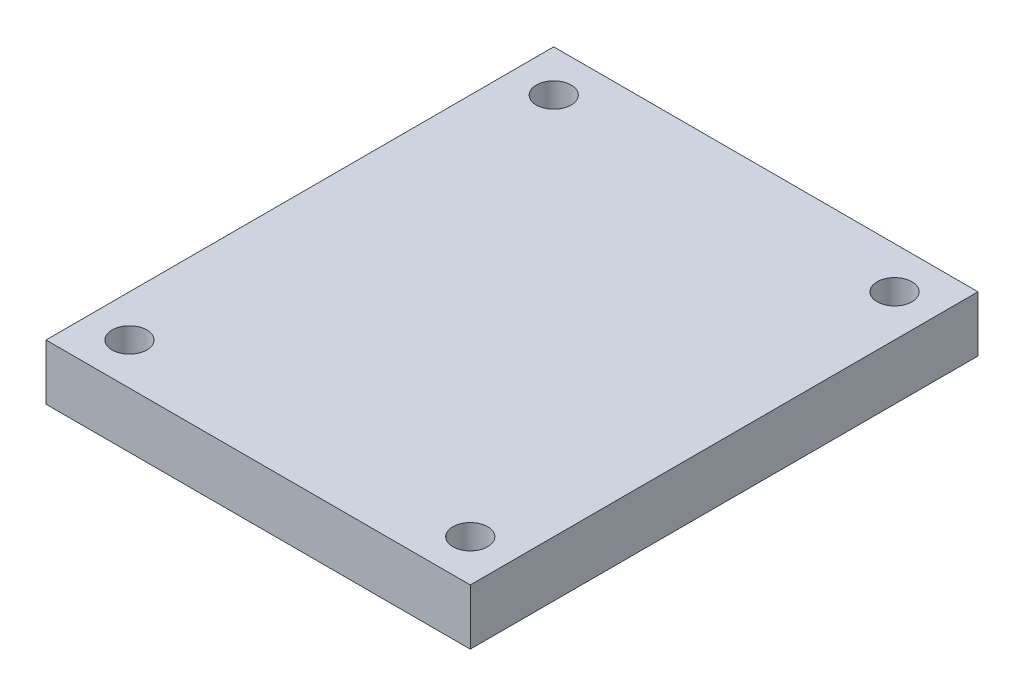
ISO-10303-21;
HEADER;
FILE_DESCRIPTION(('STEP AP214'),'2;1');
FILE_NAME('part.step','',(''),(''),'','','');
FILE_SCHEMA(('AUTOMOTIVE_DESIGN { 1 0 10303 214 1 1 1 1 }'));
ENDSEC;
DATA;
#1=APPLICATION_CONTEXT('core data for automotive mechanical design processes');
#2=APPLICATION_PROTOCOL_DEFINITION('international standard','automotive_design',2000,#1);
#3=PRODUCT_CONTEXT('',#1,'mechanical');
#4=PRODUCT('Part','Part','',(#3));
#5=PRODUCT_RELATED_PRODUCT_CATEGORY('part','',(#4));
#6=PRODUCT_DEFINITION_FORMATION('','',#4);
#7=PRODUCT_DEFINITION_CONTEXT('part definition',#1,'design');
#8=PRODUCT_DEFINITION('design','',#6,#7);
#9=PRODUCT_DEFINITION_SHAPE('','',#8);
#10=(LENGTH_UNIT() NAMED_UNIT(*) SI_UNIT(.MILLI.,.METRE.));
#11=(NAMED_UNIT(*) PLANE_ANGLE_UNIT() SI_UNIT($,.RADIAN.));
#12=(NAMED_UNIT(*) SI_UNIT($,.STERADIAN.) SOLID_ANGLE_UNIT());
#13=UNCERTAINTY_MEASURE_WITH_UNIT(LENGTH_MEASURE(1.E-05),#10,'distance_accuracy_value','');
#14=(GEOMETRIC_REPRESENTATION_CONTEXT(3) GLOBAL_UNCERTAINTY_ASSIGNED_CONTEXT((#13)) GLOBAL_UNIT_ASSIGNED_CONTEXT((#10,
#11,#12)) REPRESENTATION_CONTEXT('',''));
#15=CARTESIAN_POINT('',(0.,0.,0.));
#16=DIRECTION('',(0.,0.,1.));
#17=DIRECTION('',(1.,0.,0.));
#18=AXIS2_PLACEMENT_3D('',#15,#16,#17);
#19=CARTESIAN_POINT('',(0.,2.,0.));
#20=DIRECTION('',(0.,1.,0.));
#21=DIRECTION('',(0.,0.,1.));
#22=AXIS2_PLACEMENT_3D('',#19,#20,#21);
#23=PLANE('',#22);
#24=CARTESIAN_POINT('',(-12.25,2.,-15.25));
#25=DIRECTION('',(0.,1.,0.));
#26=DIRECTION('',(0.,0.,1.));
#27=AXIS2_PLACEMENT_3D('',#24,#25,#26);
#28=CIRCLE('',#27,1.25);
#29=CARTESIAN_POINT('',(-12.25,2.,-14.));
#30=VERTEX_POINT('',#29);
#31=EDGE_CURVE('E165',#30,#30,#28,.T.);
#32=ORIENTED_EDGE('',*,*,#31,.F.);
#33=EDGE_LOOP('',(#32));
#34=FACE_BOUND('',#33,.T.);
#35=CARTESIAN_POINT('',(12.25,2.,-15.25));
#36=DIRECTION('',(0.,1.,0.));
#37=DIRECTION('',(0.,0.,1.));
#38=AXIS2_PLACEMENT_3D('',#35,#36,#37);
#39=CIRCLE('',#38,1.25);
#40=CARTESIAN_POINT('',(12.25,2.,-14.));
#41=VERTEX_POINT('',#40);
#42=EDGE_CURVE('E161',#41,#41,#39,.T.);
#43=ORIENTED_EDGE('',*,*,#42,.F.);
#44=EDGE_LOOP('',(#43));
#45=FACE_BOUND('',#44,.T.);
#46=CARTESIAN_POINT('',(-12.25,2.,15.25));
#47=DIRECTION('',(0.,1.,0.));
#48=DIRECTION('',(0.,0.,1.));
#49=AXIS2_PLACEMENT_3D('',#46,#47,#48);
#50=CIRCLE('',#49,1.25);
#51=CARTESIAN_POINT('',(-12.25,2.,16.5));
#52=VERTEX_POINT('',#51);
#53=EDGE_CURVE('E157',#52,#52,#50,.T.);
#54=ORIENTED_EDGE('',*,*,#53,.F.);
#55=EDGE_LOOP('',(#54));
#56=FACE_BOUND('',#55,.T.);
#57=CARTESIAN_POINT('',(12.25,2.,15.25));
#58=DIRECTION('',(0.,1.,0.));
#59=DIRECTION('',(0.,0.,1.));
#60=AXIS2_PLACEMENT_3D('',#57,#58,#59);
#61=CIRCLE('',#60,1.25);
#62=CARTESIAN_POINT('',(12.25,2.,16.5));
#63=VERTEX_POINT('',#62);
#64=EDGE_CURVE('E152',#63,#63,#61,.T.);
#65=ORIENTED_EDGE('',*,*,#64,.F.);
#66=EDGE_LOOP('',(#65));
#67=FACE_BOUND('',#66,.T.);
#68=DIRECTION('',(0.,0.,1.));
#69=VECTOR('',#68,1.);
#70=CARTESIAN_POINT('',(-15.25,2.,-18.25));
#71=LINE('',#70,#69);
#72=CARTESIAN_POINT('',(-15.25,2.,-18.25));
#73=VERTEX_POINT('',#72);
#74=CARTESIAN_POINT('',(-15.25,2.,18.25));
#75=VERTEX_POINT('',#74);
#76=EDGE_CURVE('E99',#73,#75,#71,.T.);
#77=ORIENTED_EDGE('',*,*,#76,.T.);
#78=DIRECTION('',(1.,0.,0.));
#79=VECTOR('',#78,1.);
#80=CARTESIAN_POINT('',(-15.25,2.,18.25));
#81=LINE('',#80,#79);
#82=CARTESIAN_POINT('',(15.25,2.,18.25));
#83=VERTEX_POINT('',#82);
#84=EDGE_CURVE('E102',#75,#83,#81,.T.);
#85=ORIENTED_EDGE('',*,*,#84,.T.);
#86=DIRECTION('',(0.,0.,-1.));
#87=VECTOR('',#86,1.);
#88=CARTESIAN_POINT('',(15.25,2.,-18.25));
#89=LINE('',#88,#87);
#90=CARTESIAN_POINT('',(15.25,2.,-18.25));
#91=VERTEX_POINT('',#90);
#92=EDGE_CURVE('E85',#83,#91,#89,.T.);
#93=ORIENTED_EDGE('',*,*,#92,.T.);
#94=DIRECTION('',(-1.,0.,0.));
#95=VECTOR('',#94,1.);
#96=CARTESIAN_POINT('',(-15.25,2.,-18.25));
#97=LINE('',#96,#95);
#98=EDGE_CURVE('E94',#91,#73,#97,.T.);
#99=ORIENTED_EDGE('',*,*,#98,.T.);
#100=EDGE_LOOP('',(#77,#85,#93,#99));
#101=FACE_BOUND('',#100,.T.);
#102=ADVANCED_FACE('F34',(#34,#45,#56,#67,#101),#23,.T.);
#103=CARTESIAN_POINT('',(-15.25,-2.,-18.25));
#104=DIRECTION('',(-1.,0.,0.));
#105=DIRECTION('',(0.,0.,1.));
#106=AXIS2_PLACEMENT_3D('',#103,#104,#105);
#107=PLANE('',#106);
#108=ORIENTED_EDGE('',*,*,#76,.F.);
#109=DIRECTION('',(0.,1.,0.));
#110=VECTOR('',#109,1.);
#111=CARTESIAN_POINT('',(-15.25,-2.,-18.25));
#112=LINE('',#111,#110);
#113=CARTESIAN_POINT('',(-15.25,-2.,-18.25));
#114=VERTEX_POINT('',#113);
#115=EDGE_CURVE('E11',#114,#73,#112,.T.);
#116=ORIENTED_EDGE('',*,*,#115,.F.);
#117=DIRECTION('',(0.,0.,1.));
#118=VECTOR('',#117,1.);
#119=CARTESIAN_POINT('',(-15.25,-2.,-18.25));
#120=LINE('',#119,#118);
#121=CARTESIAN_POINT('',(-15.25,-2.,18.25));
#122=VERTEX_POINT('',#121);
#123=EDGE_CURVE('E92',#114,#122,#120,.T.);
#124=ORIENTED_EDGE('',*,*,#123,.T.);
#125=DIRECTION('',(0.,1.,0.));
#126=VECTOR('',#125,1.);
#127=CARTESIAN_POINT('',(-15.25,-2.,18.25));
#128=LINE('',#127,#126);
#129=EDGE_CURVE('E38',#122,#75,#128,.T.);
#130=ORIENTED_EDGE('',*,*,#129,.T.);
#131=EDGE_LOOP('',(#108,#116,#124,#130));
#132=FACE_BOUND('',#131,.T.);
#133=ADVANCED_FACE('F111',(#132),#107,.T.);
#134=CARTESIAN_POINT('',(-15.25,-2.,-18.25));
#135=DIRECTION('',(0.,0.,-1.));
#136=DIRECTION('',(-1.,0.,0.));
#137=AXIS2_PLACEMENT_3D('',#134,#135,#136);
#138=PLANE('',#137);
#139=ORIENTED_EDGE('',*,*,#98,.F.);
#140=DIRECTION('',(0.,1.,0.));
#141=VECTOR('',#140,1.);
#142=CARTESIAN_POINT('',(15.25,-2.,-18.25));
#143=LINE('',#142,#141);
#144=CARTESIAN_POINT('',(15.25,-2.,-18.25));
#145=VERTEX_POINT('',#144);
#146=EDGE_CURVE('E44',#145,#91,#143,.T.);
#147=ORIENTED_EDGE('',*,*,#146,.F.);
#148=DIRECTION('',(-1.,0.,0.));
#149=VECTOR('',#148,1.);
#150=CARTESIAN_POINT('',(-15.25,-2.,-18.25));
#151=LINE('',#150,#149);
#152=EDGE_CURVE('E89',#145,#114,#151,.T.);
#153=ORIENTED_EDGE('',*,*,#152,.T.);
#154=ORIENTED_EDGE('',*,*,#115,.T.);
#155=EDGE_LOOP('',(#139,#147,#153,#154));
#156=FACE_BOUND('',#155,.T.);
#157=ADVANCED_FACE('F109',(#156),#138,.T.);
#158=CARTESIAN_POINT('',(15.25,-2.,-18.25));
#159=DIRECTION('',(1.,0.,0.));
#160=DIRECTION('',(0.,0.,-1.));
#161=AXIS2_PLACEMENT_3D('',#158,#159,#160);
#162=PLANE('',#161);
#163=ORIENTED_EDGE('',*,*,#92,.F.);
#164=DIRECTION('',(0.,1.,0.));
#165=VECTOR('',#164,1.);
#166=CARTESIAN_POINT('',(15.25,-2.,18.25));
#167=LINE('',#166,#165);
#168=CARTESIAN_POINT('',(15.25,-2.,18.25));
#169=VERTEX_POINT('',#168);
#170=EDGE_CURVE('E80',#169,#83,#167,.T.);
#171=ORIENTED_EDGE('',*,*,#170,.F.);
#172=DIRECTION('',(0.,0.,-1.));
#173=VECTOR('',#172,1.);
#174=CARTESIAN_POINT('',(15.25,-2.,-18.25));
#175=LINE('',#174,#173);
#176=EDGE_CURVE('E83',#169,#145,#175,.T.);
#177=ORIENTED_EDGE('',*,*,#176,.T.);
#178=ORIENTED_EDGE('',*,*,#146,.T.);
#179=EDGE_LOOP('',(#163,#171,#177,#178));
#180=FACE_BOUND('',#179,.T.);
#181=ADVANCED_FACE('F82',(#180),#162,.T.);
#182=CARTESIAN_POINT('',(-15.25,-2.,18.25));
#183=DIRECTION('',(0.,0.,1.));
#184=DIRECTION('',(1.,0.,0.));
#185=AXIS2_PLACEMENT_3D('',#182,#183,#184);
#186=PLANE('',#185);
#187=ORIENTED_EDGE('',*,*,#84,.F.);
#188=ORIENTED_EDGE('',*,*,#129,.F.);
#189=DIRECTION('',(1.,0.,0.));
#190=VECTOR('',#189,1.);
#191=CARTESIAN_POINT('',(-15.25,-2.,18.25));
#192=LINE('',#191,#190);
#193=EDGE_CURVE('E88',#122,#169,#192,.T.);
#194=ORIENTED_EDGE('',*,*,#193,.T.);
#195=ORIENTED_EDGE('',*,*,#170,.T.);
#196=EDGE_LOOP('',(#187,#188,#194,#195));
#197=FACE_BOUND('',#196,.T.);
#198=ADVANCED_FACE('F91',(#197),#186,.T.);
#199=CARTESIAN_POINT('',(0.,-2.,0.));
#200=DIRECTION('',(0.,1.,0.));
#201=DIRECTION('',(0.,0.,1.));
#202=AXIS2_PLACEMENT_3D('',#199,#200,#201);
#203=PLANE('',#202);
#204=CARTESIAN_POINT('',(-12.25,-2.,-15.25));
#205=DIRECTION('',(0.,1.,0.));
#206=DIRECTION('',(0.,0.,1.));
#207=AXIS2_PLACEMENT_3D('',#204,#205,#206);
#208=CIRCLE('',#207,1.25);
#209=CARTESIAN_POINT('',(-12.25,-2.,-14.));
#210=VERTEX_POINT('',#209);
#211=EDGE_CURVE('E141',#210,#210,#208,.T.);
#212=ORIENTED_EDGE('',*,*,#211,.T.);
#213=EDGE_LOOP('',(#212));
#214=FACE_BOUND('',#213,.T.);
#215=CARTESIAN_POINT('',(12.25,-2.,-15.25));
#216=DIRECTION('',(0.,1.,0.));
#217=DIRECTION('',(0.,0.,1.));
#218=AXIS2_PLACEMENT_3D('',#215,#216,#217);
#219=CIRCLE('',#218,1.25);
#220=CARTESIAN_POINT('',(12.25,-2.,-14.));
#221=VERTEX_POINT('',#220);
#222=EDGE_CURVE('E145',#221,#221,#219,.T.);
#223=ORIENTED_EDGE('',*,*,#222,.T.);
#224=EDGE_LOOP('',(#223));
#225=FACE_BOUND('',#224,.T.);
#226=CARTESIAN_POINT('',(-12.25,-2.,15.25));
#227=DIRECTION('',(0.,1.,0.));
#228=DIRECTION('',(0.,0.,1.));
#229=AXIS2_PLACEMENT_3D('',#226,#227,#228);
#230=CIRCLE('',#229,1.25);
#231=CARTESIAN_POINT('',(-12.25,-2.,16.5));
#232=VERTEX_POINT('',#231);
#233=EDGE_CURVE('E149',#232,#232,#230,.T.);
#234=ORIENTED_EDGE('',*,*,#233,.T.);
#235=EDGE_LOOP('',(#234));
#236=FACE_BOUND('',#235,.T.);
#237=CARTESIAN_POINT('',(12.25,-2.,15.25));
#238=DIRECTION('',(0.,1.,0.));
#239=DIRECTION('',(0.,0.,1.));
#240=AXIS2_PLACEMENT_3D('',#237,#238,#239);
#241=CIRCLE('',#240,1.25);
#242=CARTESIAN_POINT('',(12.25,-2.,16.5));
#243=VERTEX_POINT('',#242);
#244=EDGE_CURVE('E103',#243,#243,#241,.T.);
#245=ORIENTED_EDGE('',*,*,#244,.T.);
#246=EDGE_LOOP('',(#245));
#247=FACE_BOUND('',#246,.T.);
#248=ORIENTED_EDGE('',*,*,#123,.F.);
#249=ORIENTED_EDGE('',*,*,#152,.F.);
#250=ORIENTED_EDGE('',*,*,#176,.F.);
#251=ORIENTED_EDGE('',*,*,#193,.F.);
#252=EDGE_LOOP('',(#248,#249,#250,#251));
#253=FACE_BOUND('',#252,.T.);
#254=ADVANCED_FACE('F36',(#214,#225,#236,#247,#253),#203,.F.);
#255=CARTESIAN_POINT('',(12.25,2.,15.25));
#256=DIRECTION('',(0.,1.,0.));
#257=DIRECTION('',(0.,0.,1.));
#258=AXIS2_PLACEMENT_3D('',#255,#256,#257);
#259=CYLINDRICAL_SURFACE('',#258,1.25);
#260=ORIENTED_EDGE('',*,*,#244,.F.);
#261=EDGE_LOOP('',(#260));
#262=FACE_BOUND('',#261,.T.);
#263=ORIENTED_EDGE('',*,*,#64,.T.);
#264=EDGE_LOOP('',(#263));
#265=FACE_BOUND('',#264,.T.);
#266=ADVANCED_FACE('F131',(#262,#265),#259,.F.);
#267=CARTESIAN_POINT('',(-12.25,2.,15.25));
#268=DIRECTION('',(0.,1.,0.));
#269=DIRECTION('',(0.,0.,1.));
#270=AXIS2_PLACEMENT_3D('',#267,#268,#269);
#271=CYLINDRICAL_SURFACE('',#270,1.25);
#272=ORIENTED_EDGE('',*,*,#233,.F.);
#273=EDGE_LOOP('',(#272));
#274=FACE_BOUND('',#273,.T.);
#275=ORIENTED_EDGE('',*,*,#53,.T.);
#276=EDGE_LOOP('',(#275));
#277=FACE_BOUND('',#276,.T.);
#278=ADVANCED_FACE('F136',(#274,#277),#271,.F.);
#279=CARTESIAN_POINT('',(12.25,2.,-15.25));
#280=DIRECTION('',(0.,1.,0.));
#281=DIRECTION('',(0.,0.,1.));
#282=AXIS2_PLACEMENT_3D('',#279,#280,#281);
#283=CYLINDRICAL_SURFACE('',#282,1.25);
#284=ORIENTED_EDGE('',*,*,#222,.F.);
#285=EDGE_LOOP('',(#284));
#286=FACE_BOUND('',#285,.T.);
#287=ORIENTED_EDGE('',*,*,#42,.T.);
#288=EDGE_LOOP('',(#287));
#289=FACE_BOUND('',#288,.T.);
#290=ADVANCED_FACE('F170',(#286,#289),#283,.F.);
#291=CARTESIAN_POINT('',(-12.25,2.,-15.25));
#292=DIRECTION('',(0.,1.,0.));
#293=DIRECTION('',(0.,0.,1.));
#294=AXIS2_PLACEMENT_3D('',#291,#292,#293);
#295=CYLINDRICAL_SURFACE('',#294,1.25);
#296=ORIENTED_EDGE('',*,*,#211,.F.);
#297=EDGE_LOOP('',(#296));
#298=FACE_BOUND('',#297,.T.);
#299=ORIENTED_EDGE('',*,*,#31,.T.);
#300=EDGE_LOOP('',(#299));
#301=FACE_BOUND('',#300,.T.);
#302=ADVANCED_FACE('F168',(#298,#301),#295,.F.);
#303=CLOSED_SHELL('',(#102,#133,#157,#181,#198,#254,#266,#278,#290,#302));
#304=MANIFOLD_SOLID_BREP('B2',#303);
#305=ADVANCED_BREP_SHAPE_REPRESENTATION('',(#18,#304),#14);
#306=SHAPE_DEFINITION_REPRESENTATION(#9,#305);
ENDSEC;
END-ISO-10303-21;
